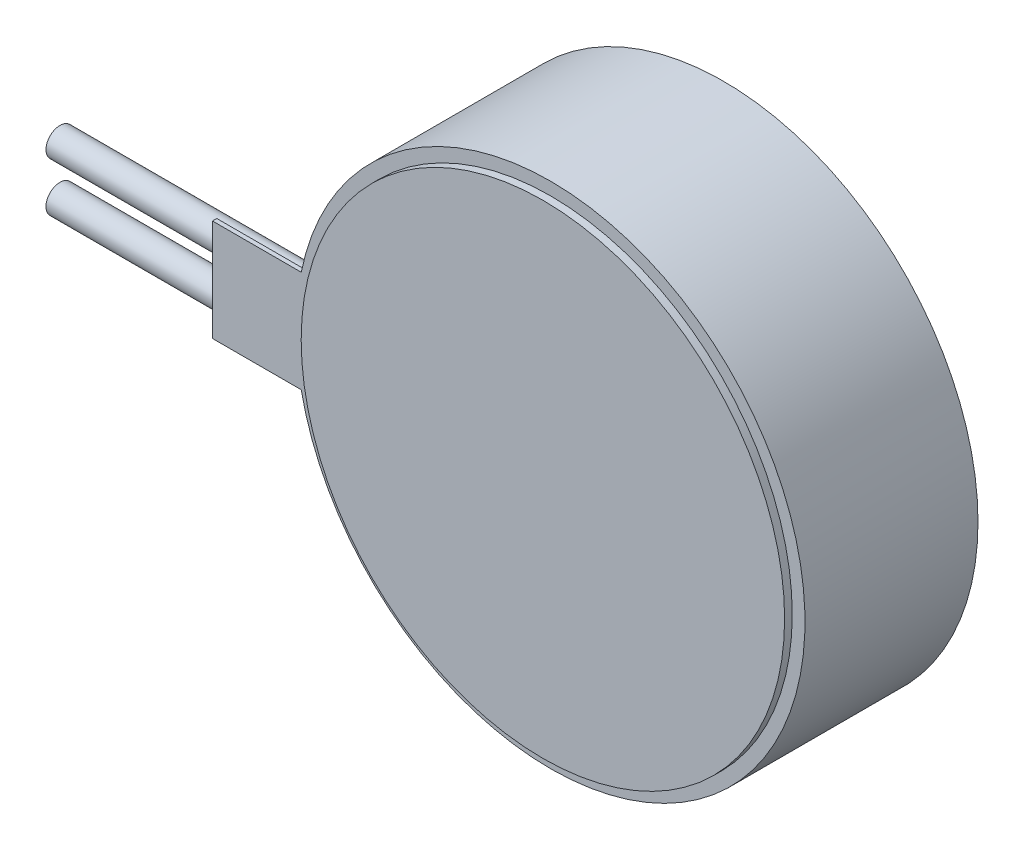
ISO-10303-21;
HEADER;
FILE_DESCRIPTION(('STEP AP214'),'2;1');
FILE_NAME('part.step','',(''),(''),'','','');
FILE_SCHEMA(('AUTOMOTIVE_DESIGN { 1 0 10303 214 1 1 1 1 }'));
ENDSEC;
DATA;
#1=APPLICATION_CONTEXT('core data for automotive mechanical design processes');
#2=APPLICATION_PROTOCOL_DEFINITION('international standard','automotive_design',2000,#1);
#3=PRODUCT_CONTEXT('',#1,'mechanical');
#4=PRODUCT('Part','Part','',(#3));
#5=PRODUCT_RELATED_PRODUCT_CATEGORY('part','',(#4));
#6=PRODUCT_DEFINITION_FORMATION('','',#4);
#7=PRODUCT_DEFINITION_CONTEXT('part definition',#1,'design');
#8=PRODUCT_DEFINITION('design','',#6,#7);
#9=PRODUCT_DEFINITION_SHAPE('','',#8);
#10=(LENGTH_UNIT() NAMED_UNIT(*) SI_UNIT(.MILLI.,.METRE.));
#11=(NAMED_UNIT(*) PLANE_ANGLE_UNIT() SI_UNIT($,.RADIAN.));
#12=(NAMED_UNIT(*) SI_UNIT($,.STERADIAN.) SOLID_ANGLE_UNIT());
#13=UNCERTAINTY_MEASURE_WITH_UNIT(LENGTH_MEASURE(1.E-05),#10,'distance_accuracy_value','');
#14=(GEOMETRIC_REPRESENTATION_CONTEXT(3) GLOBAL_UNCERTAINTY_ASSIGNED_CONTEXT((#13)) GLOBAL_UNIT_ASSIGNED_CONTEXT((#10,
#11,#12)) REPRESENTATION_CONTEXT('',''));
#15=CARTESIAN_POINT('',(0.,0.,0.));
#16=DIRECTION('',(0.,0.,1.));
#17=DIRECTION('',(1.,0.,0.));
#18=AXIS2_PLACEMENT_3D('',#15,#16,#17);
#19=CARTESIAN_POINT('',(-10.,0.493364025366365,3.04));
#20=DIRECTION('',(1.,0.,0.));
#21=DIRECTION('',(0.,0.,-1.));
#22=AXIS2_PLACEMENT_3D('',#19,#20,#21);
#23=CYLINDRICAL_SURFACE('',#22,0.275);
#24=CARTESIAN_POINT('',(-10.,0.493364025366365,3.04));
#25=DIRECTION('',(1.,0.,0.));
#26=DIRECTION('',(0.,0.,-1.));
#27=AXIS2_PLACEMENT_3D('',#24,#25,#26);
#28=CIRCLE('',#27,0.275);
#29=CARTESIAN_POINT('',(-10.,0.493364025366365,2.765));
#30=VERTEX_POINT('',#29);
#31=EDGE_CURVE('E47',#30,#30,#28,.T.);
#32=ORIENTED_EDGE('',*,*,#31,.T.);
#33=EDGE_LOOP('',(#32));
#34=FACE_BOUND('',#33,.T.);
#35=CARTESIAN_POINT('',(0.,0.493364025366365,3.04));
#36=DIRECTION('',(1.,0.,0.));
#37=DIRECTION('',(0.,0.,-1.));
#38=AXIS2_PLACEMENT_3D('',#35,#36,#37);
#39=CIRCLE('',#38,0.275);
#40=CARTESIAN_POINT('',(0.,0.493364025366365,2.765));
#41=VERTEX_POINT('',#40);
#42=EDGE_CURVE('E11',#41,#41,#39,.T.);
#43=ORIENTED_EDGE('',*,*,#42,.F.);
#44=EDGE_LOOP('',(#43));
#45=FACE_BOUND('',#44,.T.);
#46=ADVANCED_FACE('F43',(#34,#45),#23,.T.);
#47=CARTESIAN_POINT('',(-10.,0.493364025366365,3.04));
#48=DIRECTION('',(1.,0.,0.));
#49=DIRECTION('',(0.,0.,-1.));
#50=AXIS2_PLACEMENT_3D('',#47,#48,#49);
#51=PLANE('',#50);
#52=ORIENTED_EDGE('',*,*,#31,.F.);
#53=EDGE_LOOP('',(#52));
#54=FACE_BOUND('',#53,.T.);
#55=ADVANCED_FACE('F45',(#54),#51,.F.);
#56=CARTESIAN_POINT('',(0.,0.493364025366365,3.04));
#57=DIRECTION('',(1.,0.,0.));
#58=DIRECTION('',(0.,0.,-1.));
#59=AXIS2_PLACEMENT_3D('',#56,#57,#58);
#60=PLANE('',#59);
#61=ORIENTED_EDGE('',*,*,#42,.T.);
#62=EDGE_LOOP('',(#61));
#63=FACE_BOUND('',#62,.T.);
#64=ADVANCED_FACE('F61',(#63),#60,.T.);
#65=CLOSED_SHELL('',(#46,#55,#64));
#66=MANIFOLD_SOLID_BREP('B2',#65);
#67=CARTESIAN_POINT('',(-10.,-0.47511864699486,3.04));
#68=DIRECTION('',(1.,0.,0.));
#69=DIRECTION('',(0.,0.,-1.));
#70=AXIS2_PLACEMENT_3D('',#67,#68,#69);
#71=CYLINDRICAL_SURFACE('',#70,0.275);
#72=CARTESIAN_POINT('',(-10.,-0.47511864699486,3.04));
#73=DIRECTION('',(1.,0.,0.));
#74=DIRECTION('',(0.,0.,-1.));
#75=AXIS2_PLACEMENT_3D('',#72,#73,#74);
#76=CIRCLE('',#75,0.275);
#77=CARTESIAN_POINT('',(-10.,-0.47511864699486,2.765));
#78=VERTEX_POINT('',#77);
#79=EDGE_CURVE('E42',#78,#78,#76,.T.);
#80=ORIENTED_EDGE('',*,*,#79,.T.);
#81=EDGE_LOOP('',(#80));
#82=FACE_BOUND('',#81,.T.);
#83=CARTESIAN_POINT('',(0.,-0.47511864699486,3.04));
#84=DIRECTION('',(1.,0.,0.));
#85=DIRECTION('',(0.,0.,-1.));
#86=AXIS2_PLACEMENT_3D('',#83,#84,#85);
#87=CIRCLE('',#86,0.275);
#88=CARTESIAN_POINT('',(0.,-0.47511864699486,2.765));
#89=VERTEX_POINT('',#88);
#90=EDGE_CURVE('E97',#89,#89,#87,.T.);
#91=ORIENTED_EDGE('',*,*,#90,.F.);
#92=EDGE_LOOP('',(#91));
#93=FACE_BOUND('',#92,.T.);
#94=ADVANCED_FACE('F94',(#82,#93),#71,.T.);
#95=CARTESIAN_POINT('',(-10.,-0.47511864699486,3.04));
#96=DIRECTION('',(1.,0.,0.));
#97=DIRECTION('',(0.,0.,-1.));
#98=AXIS2_PLACEMENT_3D('',#95,#96,#97);
#99=PLANE('',#98);
#100=ORIENTED_EDGE('',*,*,#79,.F.);
#101=EDGE_LOOP('',(#100));
#102=FACE_BOUND('',#101,.T.);
#103=ADVANCED_FACE('F111',(#102),#99,.F.);
#104=CARTESIAN_POINT('',(0.,-0.47511864699486,3.04));
#105=DIRECTION('',(1.,0.,0.));
#106=DIRECTION('',(0.,0.,-1.));
#107=AXIS2_PLACEMENT_3D('',#104,#105,#106);
#108=PLANE('',#107);
#109=ORIENTED_EDGE('',*,*,#90,.T.);
#110=EDGE_LOOP('',(#109));
#111=FACE_BOUND('',#110,.T.);
#112=ADVANCED_FACE('F108',(#111),#108,.T.);
#113=CLOSED_SHELL('',(#94,#103,#112));
#114=MANIFOLD_SOLID_BREP('B6',#113);
#115=CARTESIAN_POINT('',(0.,0.,3.4));
#116=DIRECTION('',(0.,0.,1.));
#117=DIRECTION('',(1.,0.,0.));
#118=AXIS2_PLACEMENT_3D('',#115,#116,#117);
#119=PLANE('',#118);
#120=CARTESIAN_POINT('',(0.,0.,3.4));
#121=DIRECTION('',(0.,0.,1.));
#122=DIRECTION('',(1.,0.,0.));
#123=AXIS2_PLACEMENT_3D('',#120,#121,#122);
#124=CIRCLE('',#123,4.75);
#125=CARTESIAN_POINT('',(4.75,0.,3.4));
#126=VERTEX_POINT('',#125);
#127=EDGE_CURVE('E213',#126,#126,#124,.T.);
#128=ORIENTED_EDGE('',*,*,#127,.F.);
#129=EDGE_LOOP('',(#128));
#130=FACE_BOUND('',#129,.T.);
#131=DIRECTION('',(1.,0.,0.));
#132=VECTOR('',#131,1.);
#133=CARTESIAN_POINT('',(-4.64354390525168,-1.,3.4));
#134=LINE('',#133,#132);
#135=CARTESIAN_POINT('',(-6.64354390525168,-1.,3.4));
#136=VERTEX_POINT('',#135);
#137=CARTESIAN_POINT('',(-4.89897948556636,-1.,3.4));
#138=VERTEX_POINT('',#137);
#139=EDGE_CURVE('E152',#136,#138,#134,.T.);
#140=ORIENTED_EDGE('',*,*,#139,.T.);
#141=CARTESIAN_POINT('',(0.,0.,3.4));
#142=DIRECTION('',(0.,0.,1.));
#143=DIRECTION('',(1.,0.,0.));
#144=AXIS2_PLACEMENT_3D('',#141,#142,#143);
#145=CIRCLE('',#144,5.);
#146=CARTESIAN_POINT('',(-4.89897948556636,0.999999999999999,3.4));
#147=VERTEX_POINT('',#146);
#148=EDGE_CURVE('E222',#138,#147,#145,.T.);
#149=ORIENTED_EDGE('',*,*,#148,.T.);
#150=DIRECTION('',(-1.,0.,0.));
#151=VECTOR('',#150,1.);
#152=CARTESIAN_POINT('',(-4.64354390525168,0.999999999999999,3.4));
#153=LINE('',#152,#151);
#154=CARTESIAN_POINT('',(-6.64354390525168,0.999999999999999,3.4));
#155=VERTEX_POINT('',#154);
#156=EDGE_CURVE('E206',#147,#155,#153,.T.);
#157=ORIENTED_EDGE('',*,*,#156,.T.);
#158=DIRECTION('',(0.,-1.,0.));
#159=VECTOR('',#158,1.);
#160=CARTESIAN_POINT('',(-6.64354390525168,0.999999999999999,3.4));
#161=LINE('',#160,#159);
#162=EDGE_CURVE('E192',#155,#136,#161,.T.);
#163=ORIENTED_EDGE('',*,*,#162,.T.);
#164=EDGE_LOOP('',(#140,#149,#157,#163));
#165=FACE_BOUND('',#164,.T.);
#166=ADVANCED_FACE('F136',(#130,#165),#119,.T.);
#167=CARTESIAN_POINT('',(0.,0.,3.4));
#168=DIRECTION('',(0.,0.,-1.));
#169=DIRECTION('',(-1.,0.,0.));
#170=AXIS2_PLACEMENT_3D('',#167,#168,#169);
#171=CYLINDRICAL_SURFACE('',#170,5.);
#172=ORIENTED_EDGE('',*,*,#148,.F.);
#173=DIRECTION('',(0.,0.,-1.));
#174=VECTOR('',#173,1.);
#175=CARTESIAN_POINT('',(-4.89897948556636,-1.,3.4));
#176=LINE('',#175,#174);
#177=CARTESIAN_POINT('',(-4.89897948556636,-1.,3.315));
#178=VERTEX_POINT('',#177);
#179=EDGE_CURVE('E92',#138,#178,#176,.T.);
#180=ORIENTED_EDGE('',*,*,#179,.T.);
#181=CARTESIAN_POINT('',(0.,0.,3.315));
#182=DIRECTION('',(0.,0.,1.));
#183=DIRECTION('',(1.,0.,0.));
#184=AXIS2_PLACEMENT_3D('',#181,#182,#183);
#185=CIRCLE('',#184,5.);
#186=CARTESIAN_POINT('',(-4.89897948556636,0.999999999999999,3.315));
#187=VERTEX_POINT('',#186);
#188=EDGE_CURVE('E225',#187,#178,#185,.T.);
#189=ORIENTED_EDGE('',*,*,#188,.F.);
#190=DIRECTION('',(0.,0.,-1.));
#191=VECTOR('',#190,1.);
#192=CARTESIAN_POINT('',(-4.89897948556636,0.999999999999999,3.4));
#193=LINE('',#192,#191);
#194=EDGE_CURVE('E145',#187,#147,#193,.F.);
#195=ORIENTED_EDGE('',*,*,#194,.T.);
#196=EDGE_LOOP('',(#172,#180,#189,#195));
#197=FACE_BOUND('',#196,.T.);
#198=CARTESIAN_POINT('',(0.,0.,0.));
#199=DIRECTION('',(0.,0.,1.));
#200=DIRECTION('',(1.,0.,0.));
#201=AXIS2_PLACEMENT_3D('',#198,#199,#200);
#202=CIRCLE('',#201,5.);
#203=CARTESIAN_POINT('',(5.,0.,0.));
#204=VERTEX_POINT('',#203);
#205=EDGE_CURVE('E219',#204,#204,#202,.T.);
#206=ORIENTED_EDGE('',*,*,#205,.T.);
#207=EDGE_LOOP('',(#206));
#208=FACE_BOUND('',#207,.T.);
#209=ADVANCED_FACE('F138',(#197,#208),#171,.T.);
#210=CARTESIAN_POINT('',(0.,0.,0.));
#211=DIRECTION('',(0.,0.,1.));
#212=DIRECTION('',(1.,0.,0.));
#213=AXIS2_PLACEMENT_3D('',#210,#211,#212);
#214=PLANE('',#213);
#215=ORIENTED_EDGE('',*,*,#205,.F.);
#216=EDGE_LOOP('',(#215));
#217=FACE_BOUND('',#216,.T.);
#218=ADVANCED_FACE('F255',(#217),#214,.F.);
#219=CARTESIAN_POINT('',(0.,0.,3.55));
#220=DIRECTION('',(0.,0.,-1.));
#221=DIRECTION('',(-1.,0.,0.));
#222=AXIS2_PLACEMENT_3D('',#219,#220,#221);
#223=CYLINDRICAL_SURFACE('',#222,4.75);
#224=CARTESIAN_POINT('',(0.,0.,3.55));
#225=DIRECTION('',(0.,0.,1.));
#226=DIRECTION('',(1.,0.,0.));
#227=AXIS2_PLACEMENT_3D('',#224,#225,#226);
#228=CIRCLE('',#227,4.75);
#229=CARTESIAN_POINT('',(4.75,0.,3.55));
#230=VERTEX_POINT('',#229);
#231=EDGE_CURVE('E215',#230,#230,#228,.T.);
#232=ORIENTED_EDGE('',*,*,#231,.F.);
#233=EDGE_LOOP('',(#232));
#234=FACE_BOUND('',#233,.T.);
#235=ORIENTED_EDGE('',*,*,#127,.T.);
#236=EDGE_LOOP('',(#235));
#237=FACE_BOUND('',#236,.T.);
#238=ADVANCED_FACE('F244',(#234,#237),#223,.T.);
#239=CARTESIAN_POINT('',(0.,0.,3.55));
#240=DIRECTION('',(0.,0.,1.));
#241=DIRECTION('',(1.,0.,0.));
#242=AXIS2_PLACEMENT_3D('',#239,#240,#241);
#243=PLANE('',#242);
#244=ORIENTED_EDGE('',*,*,#231,.T.);
#245=EDGE_LOOP('',(#244));
#246=FACE_BOUND('',#245,.T.);
#247=ADVANCED_FACE('F237',(#246),#243,.T.);
#248=CARTESIAN_POINT('',(-4.64354390525168,-1.,3.315));
#249=DIRECTION('',(0.,-1.,0.));
#250=DIRECTION('',(1.,0.,0.));
#251=AXIS2_PLACEMENT_3D('',#248,#249,#250);
#252=PLANE('',#251);
#253=ORIENTED_EDGE('',*,*,#179,.F.);
#254=ORIENTED_EDGE('',*,*,#139,.F.);
#255=DIRECTION('',(0.,0.,1.));
#256=VECTOR('',#255,1.);
#257=CARTESIAN_POINT('',(-6.64354390525168,-1.,3.315));
#258=LINE('',#257,#256);
#259=CARTESIAN_POINT('',(-6.64354390525168,-1.,3.315));
#260=VERTEX_POINT('',#259);
#261=EDGE_CURVE('E194',#260,#136,#258,.T.);
#262=ORIENTED_EDGE('',*,*,#261,.F.);
#263=DIRECTION('',(1.,0.,0.));
#264=VECTOR('',#263,1.);
#265=CARTESIAN_POINT('',(-4.64354390525168,-1.,3.315));
#266=LINE('',#265,#264);
#267=EDGE_CURVE('E195',#260,#178,#266,.T.);
#268=ORIENTED_EDGE('',*,*,#267,.T.);
#269=EDGE_LOOP('',(#253,#254,#262,#268));
#270=FACE_BOUND('',#269,.T.);
#271=ADVANCED_FACE('F235',(#270),#252,.T.);
#272=CARTESIAN_POINT('',(-4.64354390525168,0.999999999999999,3.315));
#273=DIRECTION('',(0.,1.,0.));
#274=DIRECTION('',(-1.,0.,0.));
#275=AXIS2_PLACEMENT_3D('',#272,#273,#274);
#276=PLANE('',#275);
#277=ORIENTED_EDGE('',*,*,#194,.F.);
#278=DIRECTION('',(-1.,0.,0.));
#279=VECTOR('',#278,1.);
#280=CARTESIAN_POINT('',(-4.64354390525168,0.999999999999999,3.315));
#281=LINE('',#280,#279);
#282=CARTESIAN_POINT('',(-6.64354390525168,0.999999999999999,3.315));
#283=VERTEX_POINT('',#282);
#284=EDGE_CURVE('E177',#187,#283,#281,.T.);
#285=ORIENTED_EDGE('',*,*,#284,.T.);
#286=DIRECTION('',(0.,0.,1.));
#287=VECTOR('',#286,1.);
#288=CARTESIAN_POINT('',(-6.64354390525168,0.999999999999999,3.315));
#289=LINE('',#288,#287);
#290=EDGE_CURVE('E180',#283,#155,#289,.T.);
#291=ORIENTED_EDGE('',*,*,#290,.T.);
#292=ORIENTED_EDGE('',*,*,#156,.F.);
#293=EDGE_LOOP('',(#277,#285,#291,#292));
#294=FACE_BOUND('',#293,.T.);
#295=ADVANCED_FACE('F179',(#294),#276,.T.);
#296=CARTESIAN_POINT('',(0.,0.,3.315));
#297=DIRECTION('',(0.,0.,1.));
#298=DIRECTION('',(1.,0.,0.));
#299=AXIS2_PLACEMENT_3D('',#296,#297,#298);
#300=PLANE('',#299);
#301=ORIENTED_EDGE('',*,*,#284,.F.);
#302=ORIENTED_EDGE('',*,*,#188,.T.);
#303=ORIENTED_EDGE('',*,*,#267,.F.);
#304=DIRECTION('',(0.,-1.,0.));
#305=VECTOR('',#304,1.);
#306=CARTESIAN_POINT('',(-6.64354390525168,0.999999999999999,3.315));
#307=LINE('',#306,#305);
#308=EDGE_CURVE('E186',#283,#260,#307,.T.);
#309=ORIENTED_EDGE('',*,*,#308,.F.);
#310=EDGE_LOOP('',(#301,#302,#303,#309));
#311=FACE_BOUND('',#310,.T.);
#312=ADVANCED_FACE('F197',(#311),#300,.F.);
#313=CARTESIAN_POINT('',(-6.64354390525168,0.999999999999999,3.315));
#314=DIRECTION('',(-1.,0.,0.));
#315=DIRECTION('',(0.,0.,1.));
#316=AXIS2_PLACEMENT_3D('',#313,#314,#315);
#317=PLANE('',#316);
#318=ORIENTED_EDGE('',*,*,#162,.F.);
#319=ORIENTED_EDGE('',*,*,#290,.F.);
#320=ORIENTED_EDGE('',*,*,#308,.T.);
#321=ORIENTED_EDGE('',*,*,#261,.T.);
#322=EDGE_LOOP('',(#318,#319,#320,#321));
#323=FACE_BOUND('',#322,.T.);
#324=ADVANCED_FACE('F190',(#323),#317,.T.);
#325=CLOSED_SHELL('',(#166,#209,#218,#238,#247,#271,#295,#312,#324));
#326=MANIFOLD_SOLID_BREP('B37',#325);
#327=ADVANCED_BREP_SHAPE_REPRESENTATION('',(#18,#66,#114,#326),#14);
#328=SHAPE_DEFINITION_REPRESENTATION(#9,#327);
ENDSEC;
END-ISO-10303-21;
